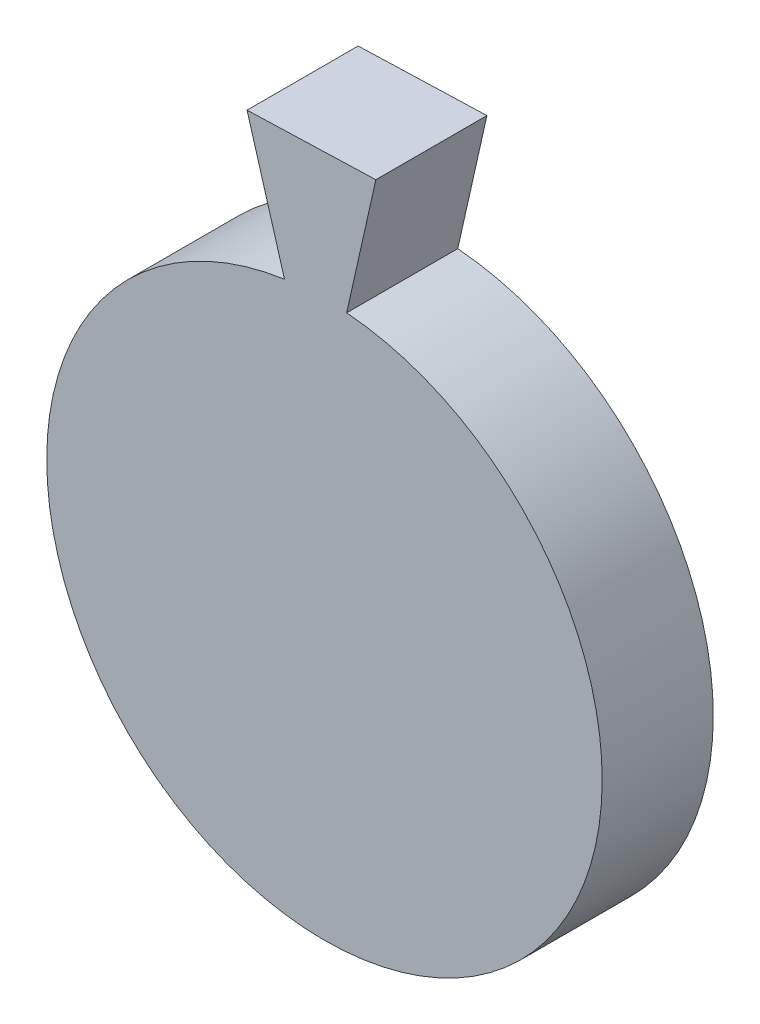
ISO-10303-21;
HEADER;
FILE_DESCRIPTION(('STEP AP214'),'2;1');
FILE_NAME('part.step','',(''),(''),'','','');
FILE_SCHEMA(('AUTOMOTIVE_DESIGN { 1 0 10303 214 1 1 1 1 }'));
ENDSEC;
DATA;
#1=APPLICATION_CONTEXT('core data for automotive mechanical design processes');
#2=APPLICATION_PROTOCOL_DEFINITION('international standard','automotive_design',2000,#1);
#3=PRODUCT_CONTEXT('',#1,'mechanical');
#4=PRODUCT('Part','Part','',(#3));
#5=PRODUCT_RELATED_PRODUCT_CATEGORY('part','',(#4));
#6=PRODUCT_DEFINITION_FORMATION('','',#4);
#7=PRODUCT_DEFINITION_CONTEXT('part definition',#1,'design');
#8=PRODUCT_DEFINITION('design','',#6,#7);
#9=PRODUCT_DEFINITION_SHAPE('','',#8);
#10=(LENGTH_UNIT() NAMED_UNIT(*) SI_UNIT(.MILLI.,.METRE.));
#11=(NAMED_UNIT(*) PLANE_ANGLE_UNIT() SI_UNIT($,.RADIAN.));
#12=(NAMED_UNIT(*) SI_UNIT($,.STERADIAN.) SOLID_ANGLE_UNIT());
#13=UNCERTAINTY_MEASURE_WITH_UNIT(LENGTH_MEASURE(1.E-05),#10,'distance_accuracy_value','');
#14=(GEOMETRIC_REPRESENTATION_CONTEXT(3) GLOBAL_UNCERTAINTY_ASSIGNED_CONTEXT((#13)) GLOBAL_UNIT_ASSIGNED_CONTEXT((#10,
#11,#12)) REPRESENTATION_CONTEXT('',''));
#15=CARTESIAN_POINT('',(0.,0.,0.));
#16=DIRECTION('',(0.,0.,1.));
#17=DIRECTION('',(1.,0.,0.));
#18=AXIS2_PLACEMENT_3D('',#15,#16,#17);
#19=CARTESIAN_POINT('',(-14.8801317233809,17.6071428571429,5.));
#20=DIRECTION('',(0.,0.,-1.));
#21=DIRECTION('',(-1.,0.,0.));
#22=AXIS2_PLACEMENT_3D('',#19,#20,#21);
#23=CYLINDRICAL_SURFACE('',#22,12.5);
#24=CARTESIAN_POINT('',(-14.8801317233809,17.6071428571429,5.));
#25=DIRECTION('',(0.,0.,1.));
#26=DIRECTION('',(1.,0.,0.));
#27=AXIS2_PLACEMENT_3D('',#24,#25,#26);
#28=CIRCLE('',#27,12.5);
#29=CARTESIAN_POINT('',(-16.6786847849499,29.9770744206043,5.));
#30=VERTEX_POINT('',#29);
#31=CARTESIAN_POINT('',(-13.8801317233809,30.06707865152,5.));
#32=VERTEX_POINT('',#31);
#33=EDGE_CURVE('E11',#30,#32,#28,.T.);
#34=ORIENTED_EDGE('',*,*,#33,.F.);
#35=DIRECTION('',(0.,0.,-1.));
#36=VECTOR('',#35,1.);
#37=CARTESIAN_POINT('',(-16.6786847849499,29.9770744206043,5.));
#38=LINE('',#37,#36);
#39=CARTESIAN_POINT('',(-16.6786847849499,29.9770744206043,0.));
#40=VERTEX_POINT('',#39);
#41=EDGE_CURVE('E80',#30,#40,#38,.T.);
#42=ORIENTED_EDGE('',*,*,#41,.T.);
#43=CARTESIAN_POINT('',(-14.8801317233809,17.6071428571429,0.));
#44=DIRECTION('',(0.,0.,1.));
#45=DIRECTION('',(1.,0.,0.));
#46=AXIS2_PLACEMENT_3D('',#43,#44,#45);
#47=CIRCLE('',#46,12.5);
#48=CARTESIAN_POINT('',(-13.8801317233809,30.06707865152,0.));
#49=VERTEX_POINT('',#48);
#50=EDGE_CURVE('E35',#40,#49,#47,.T.);
#51=ORIENTED_EDGE('',*,*,#50,.T.);
#52=DIRECTION('',(0.,0.,-1.));
#53=VECTOR('',#52,1.);
#54=CARTESIAN_POINT('',(-13.8801317233809,30.06707865152,5.));
#55=LINE('',#54,#53);
#56=EDGE_CURVE('E49',#32,#49,#55,.T.);
#57=ORIENTED_EDGE('',*,*,#56,.F.);
#58=EDGE_LOOP('',(#34,#42,#51,#57));
#59=FACE_BOUND('',#58,.T.);
#60=ADVANCED_FACE('F32',(#59),#23,.T.);
#61=CARTESIAN_POINT('',(-14.8801317233809,17.6071428571429,5.));
#62=DIRECTION('',(0.,0.,1.));
#63=DIRECTION('',(1.,0.,0.));
#64=AXIS2_PLACEMENT_3D('',#61,#62,#63);
#65=PLANE('',#64);
#66=ORIENTED_EDGE('',*,*,#33,.T.);
#67=DIRECTION('',(-0.219132962425478,-0.975695006023211,0.));
#68=VECTOR('',#67,1.);
#69=CARTESIAN_POINT('',(-13.8801317233809,30.06707865152,5.));
#70=LINE('',#69,#68);
#71=CARTESIAN_POINT('',(-12.567344204437,35.9122979741892,5.));
#72=VERTEX_POINT('',#71);
#73=EDGE_CURVE('E88',#72,#32,#70,.T.);
#74=ORIENTED_EDGE('',*,*,#73,.F.);
#75=DIRECTION('',(0.999483236274647,0.0321443681841523,0.));
#76=VECTOR('',#75,1.);
#77=CARTESIAN_POINT('',(-18.3643469748299,35.7258606387211,5.));
#78=LINE('',#77,#76);
#79=CARTESIAN_POINT('',(-18.3643469748299,35.7258606387211,5.));
#80=VERTEX_POINT('',#79);
#81=EDGE_CURVE('E71',#80,#72,#78,.T.);
#82=ORIENTED_EDGE('',*,*,#81,.F.);
#83=DIRECTION('',(-0.281373903991867,0.959598210790524,0.));
#84=VECTOR('',#83,1.);
#85=CARTESIAN_POINT('',(-16.6786847849499,29.9770744206043,5.));
#86=LINE('',#85,#84);
#87=EDGE_CURVE('E86',#30,#80,#86,.T.);
#88=ORIENTED_EDGE('',*,*,#87,.F.);
#89=EDGE_LOOP('',(#66,#74,#82,#88));
#90=FACE_BOUND('',#89,.T.);
#91=ADVANCED_FACE('F85',(#90),#65,.T.);
#92=CARTESIAN_POINT('',(-14.8801317233809,17.6071428571429,0.));
#93=DIRECTION('',(0.,0.,1.));
#94=DIRECTION('',(1.,0.,0.));
#95=AXIS2_PLACEMENT_3D('',#92,#93,#94);
#96=PLANE('',#95);
#97=ORIENTED_EDGE('',*,*,#50,.F.);
#98=DIRECTION('',(-0.281373903991867,0.959598210790524,0.));
#99=VECTOR('',#98,1.);
#100=CARTESIAN_POINT('',(-16.6786847849499,29.9770744206043,0.));
#101=LINE('',#100,#99);
#102=CARTESIAN_POINT('',(-18.3643469748299,35.7258606387211,0.));
#103=VERTEX_POINT('',#102);
#104=EDGE_CURVE('E97',#40,#103,#101,.T.);
#105=ORIENTED_EDGE('',*,*,#104,.T.);
#106=DIRECTION('',(0.999483236274647,0.0321443681841569,0.));
#107=VECTOR('',#106,1.);
#108=CARTESIAN_POINT('',(-12.567344204437,35.9122979741892,0.));
#109=LINE('',#108,#107);
#110=CARTESIAN_POINT('',(-12.567344204437,35.9122979741892,0.));
#111=VERTEX_POINT('',#110);
#112=EDGE_CURVE('E74',#103,#111,#109,.T.);
#113=ORIENTED_EDGE('',*,*,#112,.T.);
#114=DIRECTION('',(-0.219132962425478,-0.975695006023211,0.));
#115=VECTOR('',#114,1.);
#116=CARTESIAN_POINT('',(-13.8801317233809,30.06707865152,0.));
#117=LINE('',#116,#115);
#118=EDGE_CURVE('E94',#111,#49,#117,.T.);
#119=ORIENTED_EDGE('',*,*,#118,.T.);
#120=EDGE_LOOP('',(#97,#105,#113,#119));
#121=FACE_BOUND('',#120,.T.);
#122=ADVANCED_FACE('F106',(#121),#96,.F.);
#123=CARTESIAN_POINT('',(-13.8801317233809,30.06707865152,5.));
#124=DIRECTION('',(0.975695006023211,-0.219132962425479,0.));
#125=DIRECTION('',(0.219132962425479,0.975695006023211,0.));
#126=AXIS2_PLACEMENT_3D('',#123,#124,#125);
#127=PLANE('',#126);
#128=ORIENTED_EDGE('',*,*,#118,.F.);
#129=DIRECTION('',(0.,0.,-1.));
#130=VECTOR('',#129,1.);
#131=CARTESIAN_POINT('',(-12.567344204437,35.9122979741892,5.));
#132=LINE('',#131,#130);
#133=EDGE_CURVE('E79',#72,#111,#132,.T.);
#134=ORIENTED_EDGE('',*,*,#133,.F.);
#135=ORIENTED_EDGE('',*,*,#73,.T.);
#136=ORIENTED_EDGE('',*,*,#56,.T.);
#137=EDGE_LOOP('',(#128,#134,#135,#136));
#138=FACE_BOUND('',#137,.T.);
#139=ADVANCED_FACE('F104',(#138),#127,.T.);
#140=CARTESIAN_POINT('',(-12.567344204437,35.9122979741892,5.));
#141=DIRECTION('',(-0.0321443681841569,0.999483236274647,0.));
#142=DIRECTION('',(-0.999483236274647,-0.0321443681841569,0.));
#143=AXIS2_PLACEMENT_3D('',#140,#141,#142);
#144=PLANE('',#143);
#145=ORIENTED_EDGE('',*,*,#112,.F.);
#146=DIRECTION('',(0.,0.,-1.));
#147=VECTOR('',#146,1.);
#148=CARTESIAN_POINT('',(-18.3643469748299,35.7258606387211,5.));
#149=LINE('',#148,#147);
#150=EDGE_CURVE('E68',#80,#103,#149,.T.);
#151=ORIENTED_EDGE('',*,*,#150,.F.);
#152=ORIENTED_EDGE('',*,*,#81,.T.);
#153=ORIENTED_EDGE('',*,*,#133,.T.);
#154=EDGE_LOOP('',(#145,#151,#152,#153));
#155=FACE_BOUND('',#154,.T.);
#156=ADVANCED_FACE('F70',(#155),#144,.T.);
#157=CARTESIAN_POINT('',(-16.6786847849499,29.9770744206043,5.));
#158=DIRECTION('',(-0.959598210790525,-0.281373903991867,0.));
#159=DIRECTION('',(0.281373903991867,-0.959598210790524,0.));
#160=AXIS2_PLACEMENT_3D('',#157,#158,#159);
#161=PLANE('',#160);
#162=ORIENTED_EDGE('',*,*,#104,.F.);
#163=ORIENTED_EDGE('',*,*,#41,.F.);
#164=ORIENTED_EDGE('',*,*,#87,.T.);
#165=ORIENTED_EDGE('',*,*,#150,.T.);
#166=EDGE_LOOP('',(#162,#163,#164,#165));
#167=FACE_BOUND('',#166,.T.);
#168=ADVANCED_FACE('F90',(#167),#161,.T.);
#169=CLOSED_SHELL('',(#60,#91,#122,#139,#156,#168));
#170=MANIFOLD_SOLID_BREP('B2',#169);
#171=ADVANCED_BREP_SHAPE_REPRESENTATION('',(#18,#170),#14);
#172=SHAPE_DEFINITION_REPRESENTATION(#9,#171);
ENDSEC;
END-ISO-10303-21;
